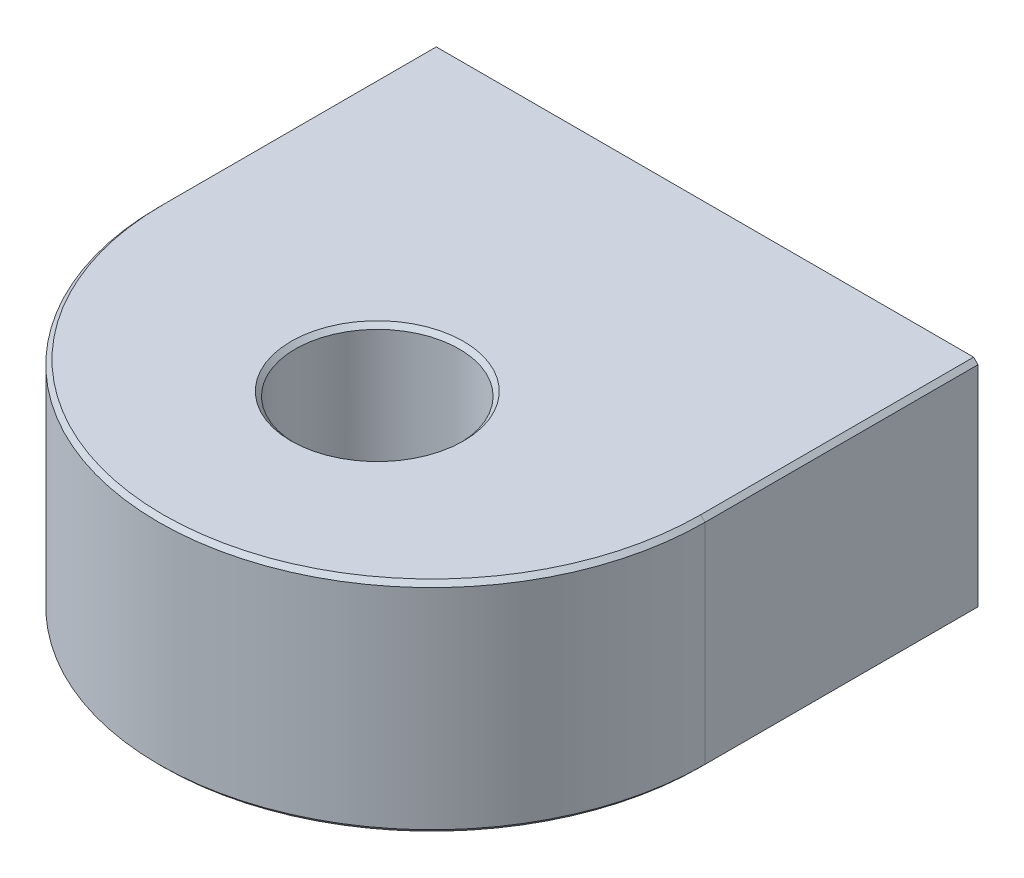
ISO-10303-21;
HEADER;
FILE_DESCRIPTION(('STEP AP214'),'2;1');
FILE_NAME('part.step','',(''),(''),'','','');
FILE_SCHEMA(('AUTOMOTIVE_DESIGN { 1 0 10303 214 1 1 1 1 }'));
ENDSEC;
DATA;
#1=APPLICATION_CONTEXT('core data for automotive mechanical design processes');
#2=APPLICATION_PROTOCOL_DEFINITION('international standard','automotive_design',2000,#1);
#3=PRODUCT_CONTEXT('',#1,'mechanical');
#4=PRODUCT('Part','Part','',(#3));
#5=PRODUCT_RELATED_PRODUCT_CATEGORY('part','',(#4));
#6=PRODUCT_DEFINITION_FORMATION('','',#4);
#7=PRODUCT_DEFINITION_CONTEXT('part definition',#1,'design');
#8=PRODUCT_DEFINITION('design','',#6,#7);
#9=PRODUCT_DEFINITION_SHAPE('','',#8);
#10=(LENGTH_UNIT() NAMED_UNIT(*) SI_UNIT(.MILLI.,.METRE.));
#11=(NAMED_UNIT(*) PLANE_ANGLE_UNIT() SI_UNIT($,.RADIAN.));
#12=(NAMED_UNIT(*) SI_UNIT($,.STERADIAN.) SOLID_ANGLE_UNIT());
#13=UNCERTAINTY_MEASURE_WITH_UNIT(LENGTH_MEASURE(1.E-05),#10,'distance_accuracy_value','');
#14=(GEOMETRIC_REPRESENTATION_CONTEXT(3) GLOBAL_UNCERTAINTY_ASSIGNED_CONTEXT((#13)) GLOBAL_UNIT_ASSIGNED_CONTEXT((#10,
#11,#12)) REPRESENTATION_CONTEXT('',''));
#15=CARTESIAN_POINT('',(0.,0.,0.));
#16=DIRECTION('',(0.,0.,1.));
#17=DIRECTION('',(1.,0.,0.));
#18=AXIS2_PLACEMENT_3D('',#15,#16,#17);
#19=CARTESIAN_POINT('',(15.875,6.35,4.7625));
#20=DIRECTION('',(0.,0.,-1.));
#21=DIRECTION('',(-1.,0.,0.));
#22=AXIS2_PLACEMENT_3D('',#19,#20,#21);
#23=PLANE('',#22);
#24=CARTESIAN_POINT('',(15.875,6.35,4.7625));
#25=DIRECTION('',(0.,0.,-1.));
#26=DIRECTION('',(-1.,0.,0.));
#27=AXIS2_PLACEMENT_3D('',#24,#25,#26);
#28=CIRCLE('',#27,4.7625);
#29=CARTESIAN_POINT('',(11.1125,6.35,4.7625));
#30=VERTEX_POINT('',#29);
#31=EDGE_CURVE('E20',#30,#30,#28,.T.);
#32=ORIENTED_EDGE('',*,*,#31,.T.);
#33=EDGE_LOOP('',(#32));
#34=FACE_BOUND('',#33,.T.);
#35=ADVANCED_FACE('F17',(#34),#23,.T.);
#36=CARTESIAN_POINT('',(5.207,6.35,19.05));
#37=DIRECTION('',(0.,0.,-1.));
#38=DIRECTION('',(-1.,0.,0.));
#39=AXIS2_PLACEMENT_3D('',#36,#37,#38);
#40=PLANE('',#39);
#41=CARTESIAN_POINT('',(5.207,6.35,19.05));
#42=DIRECTION('',(0.,0.,-1.));
#43=DIRECTION('',(-1.,0.,0.));
#44=AXIS2_PLACEMENT_3D('',#41,#42,#43);
#45=CIRCLE('',#44,2.0193);
#46=CARTESIAN_POINT('',(3.18769999999999,6.35,19.05));
#47=VERTEX_POINT('',#46);
#48=EDGE_CURVE('E124',#47,#47,#45,.T.);
#49=ORIENTED_EDGE('',*,*,#48,.T.);
#50=EDGE_LOOP('',(#49));
#51=FACE_BOUND('',#50,.T.);
#52=ADVANCED_FACE('F203',(#51),#40,.T.);
#53=CARTESIAN_POINT('',(26.543,6.35,19.05));
#54=DIRECTION('',(0.,0.,-1.));
#55=DIRECTION('',(-1.,0.,0.));
#56=AXIS2_PLACEMENT_3D('',#53,#54,#55);
#57=PLANE('',#56);
#58=CARTESIAN_POINT('',(26.543,6.35,19.05));
#59=DIRECTION('',(0.,0.,-1.));
#60=DIRECTION('',(-1.,0.,0.));
#61=AXIS2_PLACEMENT_3D('',#58,#59,#60);
#62=CIRCLE('',#61,2.0193);
#63=CARTESIAN_POINT('',(24.5237,6.35,19.05));
#64=VERTEX_POINT('',#63);
#65=EDGE_CURVE('E74',#64,#64,#62,.T.);
#66=ORIENTED_EDGE('',*,*,#65,.T.);
#67=EDGE_LOOP('',(#66));
#68=FACE_BOUND('',#67,.T.);
#69=ADVANCED_FACE('F200',(#68),#57,.T.);
#70=CARTESIAN_POINT('',(15.875,12.6999999999953,19.05));
#71=DIRECTION('',(0.,1.,0.));
#72=DIRECTION('',(0.,0.,1.));
#73=AXIS2_PLACEMENT_3D('',#70,#71,#72);
#74=CONICAL_SURFACE('',#73,5.0164999999467,0.785398163397448);
#75=CARTESIAN_POINT('',(15.875,12.6999999999953,19.05));
#76=DIRECTION('',(0.,1.,0.));
#77=DIRECTION('',(0.,0.,1.));
#78=AXIS2_PLACEMENT_3D('',#75,#76,#77);
#79=CIRCLE('',#78,5.0164999999467);
#80=CARTESIAN_POINT('',(15.875,12.6999999999953,24.0664999999467));
#81=VERTEX_POINT('',#80);
#82=EDGE_CURVE('E119',#81,#81,#79,.T.);
#83=ORIENTED_EDGE('',*,*,#82,.T.);
#84=EDGE_LOOP('',(#83));
#85=FACE_BOUND('',#84,.T.);
#86=CARTESIAN_POINT('',(15.875,12.446,19.05));
#87=DIRECTION('',(0.,1.,0.));
#88=DIRECTION('',(0.,0.,1.));
#89=AXIS2_PLACEMENT_3D('',#86,#87,#88);
#90=CIRCLE('',#89,4.7625);
#91=CARTESIAN_POINT('',(15.875,12.446,23.8125));
#92=VERTEX_POINT('',#91);
#93=EDGE_CURVE('E98',#92,#92,#90,.F.);
#94=ORIENTED_EDGE('',*,*,#93,.T.);
#95=EDGE_LOOP('',(#94));
#96=FACE_BOUND('',#95,.T.);
#97=ADVANCED_FACE('F202',(#85,#96),#74,.F.);
#98=CARTESIAN_POINT('',(31.75,12.446,0.));
#99=DIRECTION('',(0.707106781186557,0.707106781186538,0.));
#100=DIRECTION('',(-0.707106781186538,0.707106781186557,0.));
#101=AXIS2_PLACEMENT_3D('',#98,#99,#100);
#102=PLANE('',#101);
#103=DIRECTION('',(-0.707106781186538,0.707106781186557,0.));
#104=VECTOR('',#103,1.);
#105=CARTESIAN_POINT('',(31.496,12.7,15.875));
#106=LINE('',#105,#104);
#107=CARTESIAN_POINT('',(31.75,12.446,15.875));
#108=VERTEX_POINT('',#107);
#109=CARTESIAN_POINT('',(31.496,12.7,15.875));
#110=VERTEX_POINT('',#109);
#111=EDGE_CURVE('E70',#108,#110,#106,.T.);
#112=ORIENTED_EDGE('',*,*,#111,.F.);
#113=DIRECTION('',(0.,0.,-1.));
#114=VECTOR('',#113,1.);
#115=CARTESIAN_POINT('',(31.75,12.446,0.));
#116=LINE('',#115,#114);
#117=CARTESIAN_POINT('',(31.75,12.446,0.));
#118=VERTEX_POINT('',#117);
#119=EDGE_CURVE('E121',#118,#108,#116,.F.);
#120=ORIENTED_EDGE('',*,*,#119,.F.);
#121=DIRECTION('',(-0.707106781186538,0.707106781186557,0.));
#122=VECTOR('',#121,1.);
#123=CARTESIAN_POINT('',(31.75,12.446,0.));
#124=LINE('',#123,#122);
#125=CARTESIAN_POINT('',(31.496,12.7,0.));
#126=VERTEX_POINT('',#125);
#127=EDGE_CURVE('E73',#118,#126,#124,.T.);
#128=ORIENTED_EDGE('',*,*,#127,.T.);
#129=DIRECTION('',(0.,0.,-1.));
#130=VECTOR('',#129,1.);
#131=CARTESIAN_POINT('',(31.496,12.7,0.));
#132=LINE('',#131,#130);
#133=EDGE_CURVE('E60',#126,#110,#132,.F.);
#134=ORIENTED_EDGE('',*,*,#133,.T.);
#135=EDGE_LOOP('',(#112,#120,#128,#134));
#136=FACE_BOUND('',#135,.T.);
#137=ADVANCED_FACE('F68',(#136),#102,.T.);
#138=CARTESIAN_POINT('',(15.875,12.446,15.875));
#139=DIRECTION('',(0.,-1.,0.));
#140=DIRECTION('',(0.,0.,-1.));
#141=AXIS2_PLACEMENT_3D('',#138,#139,#140);
#142=CONICAL_SURFACE('',#141,15.875,0.785398163397442);
#143=DIRECTION('',(-0.707106781186541,-0.707106781186554,0.));
#144=VECTOR('',#143,1.);
#145=CARTESIAN_POINT('',(0.,12.446,15.875));
#146=LINE('',#145,#144);
#147=CARTESIAN_POINT('',(0.,12.446,15.875));
#148=VERTEX_POINT('',#147);
#149=CARTESIAN_POINT('',(0.253999999999989,12.7,15.875));
#150=VERTEX_POINT('',#149);
#151=EDGE_CURVE('E79',#148,#150,#146,.F.);
#152=ORIENTED_EDGE('',*,*,#151,.F.);
#153=CARTESIAN_POINT('',(15.875,12.446,15.875));
#154=DIRECTION('',(0.,-1.,0.));
#155=DIRECTION('',(0.,0.,-1.));
#156=AXIS2_PLACEMENT_3D('',#153,#154,#155);
#157=CIRCLE('',#156,15.875);
#158=EDGE_CURVE('E78',#108,#148,#157,.T.);
#159=ORIENTED_EDGE('',*,*,#158,.F.);
#160=ORIENTED_EDGE('',*,*,#111,.T.);
#161=CARTESIAN_POINT('',(15.875,12.7,15.875));
#162=DIRECTION('',(0.,-1.,0.));
#163=DIRECTION('',(0.,0.,-1.));
#164=AXIS2_PLACEMENT_3D('',#161,#162,#163);
#165=CIRCLE('',#164,15.621);
#166=EDGE_CURVE('E48',#110,#150,#165,.T.);
#167=ORIENTED_EDGE('',*,*,#166,.T.);
#168=EDGE_LOOP('',(#152,#159,#160,#167));
#169=FACE_BOUND('',#168,.T.);
#170=ADVANCED_FACE('F76',(#169),#142,.T.);
#171=CARTESIAN_POINT('',(0.,12.446,31.75));
#172=DIRECTION('',(-0.707106781186554,0.707106781186541,0.));
#173=DIRECTION('',(-0.707106781186541,-0.707106781186554,0.));
#174=AXIS2_PLACEMENT_3D('',#171,#172,#173);
#175=PLANE('',#174);
#176=DIRECTION('',(-0.707106781186541,-0.707106781186554,0.));
#177=VECTOR('',#176,1.);
#178=CARTESIAN_POINT('',(0.,12.446,0.));
#179=LINE('',#178,#177);
#180=CARTESIAN_POINT('',(0.253999999999991,12.7,0.));
#181=VERTEX_POINT('',#180);
#182=CARTESIAN_POINT('',(0.,12.446,0.));
#183=VERTEX_POINT('',#182);
#184=EDGE_CURVE('E81',#181,#183,#179,.T.);
#185=ORIENTED_EDGE('',*,*,#184,.T.);
#186=DIRECTION('',(0.,0.,1.));
#187=VECTOR('',#186,1.);
#188=CARTESIAN_POINT('',(0.,12.446,31.75));
#189=LINE('',#188,#187);
#190=EDGE_CURVE('E225',#148,#183,#189,.F.);
#191=ORIENTED_EDGE('',*,*,#190,.F.);
#192=ORIENTED_EDGE('',*,*,#151,.T.);
#193=DIRECTION('',(0.,0.,-1.));
#194=VECTOR('',#193,1.);
#195=CARTESIAN_POINT('',(0.253999999999991,12.7,0.));
#196=LINE('',#195,#194);
#197=EDGE_CURVE('E63',#150,#181,#196,.T.);
#198=ORIENTED_EDGE('',*,*,#197,.T.);
#199=EDGE_LOOP('',(#185,#191,#192,#198));
#200=FACE_BOUND('',#199,.T.);
#201=ADVANCED_FACE('F146',(#200),#175,.T.);
#202=CARTESIAN_POINT('',(15.875,0.,19.05));
#203=DIRECTION('',(0.,1.,0.));
#204=DIRECTION('',(0.,0.,1.));
#205=AXIS2_PLACEMENT_3D('',#202,#203,#204);
#206=CYLINDRICAL_SURFACE('',#205,4.7625);
#207=CARTESIAN_POINT('',(15.875,0.253999999983989,19.05));
#208=DIRECTION('',(0.,-1.,0.));
#209=DIRECTION('',(0.,0.,-1.));
#210=AXIS2_PLACEMENT_3D('',#207,#208,#209);
#211=CIRCLE('',#210,4.76250000003374);
#212=CARTESIAN_POINT('',(15.875,0.253999999983989,14.2874999999663));
#213=VERTEX_POINT('',#212);
#214=EDGE_CURVE('E118',#213,#213,#211,.T.);
#215=ORIENTED_EDGE('',*,*,#214,.T.);
#216=EDGE_LOOP('',(#215));
#217=FACE_BOUND('',#216,.T.);
#218=ORIENTED_EDGE('',*,*,#93,.F.);
#219=EDGE_LOOP('',(#218));
#220=FACE_BOUND('',#219,.T.);
#221=ADVANCED_FACE('F135',(#217,#220),#206,.F.);
#222=CARTESIAN_POINT('',(15.875,6.35,4.7625));
#223=DIRECTION('',(0.,0.,-1.));
#224=DIRECTION('',(-1.,0.,0.));
#225=AXIS2_PLACEMENT_3D('',#222,#223,#224);
#226=CYLINDRICAL_SURFACE('',#225,4.7625);
#227=CARTESIAN_POINT('',(15.875,6.35,0.));
#228=DIRECTION('',(0.,0.,-1.));
#229=DIRECTION('',(-1.,0.,0.));
#230=AXIS2_PLACEMENT_3D('',#227,#228,#229);
#231=CIRCLE('',#230,4.7625);
#232=CARTESIAN_POINT('',(11.1125,6.35,0.));
#233=VERTEX_POINT('',#232);
#234=EDGE_CURVE('E115',#233,#233,#231,.F.);
#235=ORIENTED_EDGE('',*,*,#234,.F.);
#236=EDGE_LOOP('',(#235));
#237=FACE_BOUND('',#236,.T.);
#238=ORIENTED_EDGE('',*,*,#31,.F.);
#239=EDGE_LOOP('',(#238));
#240=FACE_BOUND('',#239,.T.);
#241=ADVANCED_FACE('F132',(#237,#240),#226,.F.);
#242=CARTESIAN_POINT('',(5.207,6.35,19.05));
#243=DIRECTION('',(0.,0.,-1.));
#244=DIRECTION('',(-1.,0.,0.));
#245=AXIS2_PLACEMENT_3D('',#242,#243,#244);
#246=CYLINDRICAL_SURFACE('',#245,2.0193);
#247=CARTESIAN_POINT('',(5.207,6.35,0.));
#248=DIRECTION('',(0.,0.,-1.));
#249=DIRECTION('',(-1.,0.,0.));
#250=AXIS2_PLACEMENT_3D('',#247,#248,#249);
#251=CIRCLE('',#250,2.0193);
#252=CARTESIAN_POINT('',(3.18769999999999,6.35,0.));
#253=VERTEX_POINT('',#252);
#254=EDGE_CURVE('E112',#253,#253,#251,.F.);
#255=ORIENTED_EDGE('',*,*,#254,.F.);
#256=EDGE_LOOP('',(#255));
#257=FACE_BOUND('',#256,.T.);
#258=ORIENTED_EDGE('',*,*,#48,.F.);
#259=EDGE_LOOP('',(#258));
#260=FACE_BOUND('',#259,.T.);
#261=ADVANCED_FACE('F134',(#257,#260),#246,.F.);
#262=CARTESIAN_POINT('',(26.543,6.35,19.05));
#263=DIRECTION('',(0.,0.,-1.));
#264=DIRECTION('',(-1.,0.,0.));
#265=AXIS2_PLACEMENT_3D('',#262,#263,#264);
#266=CYLINDRICAL_SURFACE('',#265,2.0193);
#267=CARTESIAN_POINT('',(26.543,6.35,0.));
#268=DIRECTION('',(0.,0.,-1.));
#269=DIRECTION('',(-1.,0.,0.));
#270=AXIS2_PLACEMENT_3D('',#267,#268,#269);
#271=CIRCLE('',#270,2.0193);
#272=CARTESIAN_POINT('',(24.5237,6.35,0.));
#273=VERTEX_POINT('',#272);
#274=EDGE_CURVE('E108',#273,#273,#271,.F.);
#275=ORIENTED_EDGE('',*,*,#274,.F.);
#276=EDGE_LOOP('',(#275));
#277=FACE_BOUND('',#276,.T.);
#278=ORIENTED_EDGE('',*,*,#65,.F.);
#279=EDGE_LOOP('',(#278));
#280=FACE_BOUND('',#279,.T.);
#281=ADVANCED_FACE('F143',(#277,#280),#266,.F.);
#282=CARTESIAN_POINT('',(0.,12.7,0.));
#283=DIRECTION('',(0.,-1.,0.));
#284=DIRECTION('',(0.,0.,-1.));
#285=AXIS2_PLACEMENT_3D('',#282,#283,#284);
#286=PLANE('',#285);
#287=ORIENTED_EDGE('',*,*,#82,.F.);
#288=EDGE_LOOP('',(#287));
#289=FACE_BOUND('',#288,.T.);
#290=ORIENTED_EDGE('',*,*,#197,.F.);
#291=ORIENTED_EDGE('',*,*,#166,.F.);
#292=ORIENTED_EDGE('',*,*,#133,.F.);
#293=DIRECTION('',(-1.,0.,0.));
#294=VECTOR('',#293,1.);
#295=CARTESIAN_POINT('',(0.,12.7,0.));
#296=LINE('',#295,#294);
#297=EDGE_CURVE('E92',#181,#126,#296,.F.);
#298=ORIENTED_EDGE('',*,*,#297,.F.);
#299=EDGE_LOOP('',(#290,#291,#292,#298));
#300=FACE_BOUND('',#299,.T.);
#301=ADVANCED_FACE('F57',(#289,#300),#286,.F.);
#302=CARTESIAN_POINT('',(31.75,12.7,0.));
#303=DIRECTION('',(1.,0.,0.));
#304=DIRECTION('',(0.,0.,-1.));
#305=AXIS2_PLACEMENT_3D('',#302,#303,#304);
#306=PLANE('',#305);
#307=DIRECTION('',(0.,1.,0.));
#308=VECTOR('',#307,1.);
#309=CARTESIAN_POINT('',(31.75,12.7,0.));
#310=LINE('',#309,#308);
#311=CARTESIAN_POINT('',(31.75,0.254000000000004,0.));
#312=VERTEX_POINT('',#311);
#313=EDGE_CURVE('E111',#118,#312,#310,.F.);
#314=ORIENTED_EDGE('',*,*,#313,.F.);
#315=ORIENTED_EDGE('',*,*,#119,.T.);
#316=DIRECTION('',(0.,-1.,0.));
#317=VECTOR('',#316,1.);
#318=CARTESIAN_POINT('',(31.75,12.7,15.875));
#319=LINE('',#318,#317);
#320=CARTESIAN_POINT('',(31.75,0.254000000000004,15.875));
#321=VERTEX_POINT('',#320);
#322=EDGE_CURVE('E265',#321,#108,#319,.F.);
#323=ORIENTED_EDGE('',*,*,#322,.F.);
#324=DIRECTION('',(0.,0.,1.));
#325=VECTOR('',#324,1.);
#326=CARTESIAN_POINT('',(31.75,0.254000000000004,0.));
#327=LINE('',#326,#325);
#328=EDGE_CURVE('E94',#321,#312,#327,.F.);
#329=ORIENTED_EDGE('',*,*,#328,.T.);
#330=EDGE_LOOP('',(#314,#315,#323,#329));
#331=FACE_BOUND('',#330,.T.);
#332=ADVANCED_FACE('F184',(#331),#306,.T.);
#333=CARTESIAN_POINT('',(15.875,12.7,15.875));
#334=DIRECTION('',(0.,-1.,0.));
#335=DIRECTION('',(0.,0.,-1.));
#336=AXIS2_PLACEMENT_3D('',#333,#334,#335);
#337=CYLINDRICAL_SURFACE('',#336,15.875);
#338=CARTESIAN_POINT('',(15.875,0.254000000000003,15.875));
#339=DIRECTION('',(0.,1.,0.));
#340=DIRECTION('',(0.,0.,1.));
#341=AXIS2_PLACEMENT_3D('',#338,#339,#340);
#342=CIRCLE('',#341,15.875);
#343=CARTESIAN_POINT('',(0.,0.254000000000003,15.875));
#344=VERTEX_POINT('',#343);
#345=EDGE_CURVE('E254',#321,#344,#342,.F.);
#346=ORIENTED_EDGE('',*,*,#345,.F.);
#347=ORIENTED_EDGE('',*,*,#322,.T.);
#348=ORIENTED_EDGE('',*,*,#158,.T.);
#349=DIRECTION('',(0.,1.,0.));
#350=VECTOR('',#349,1.);
#351=CARTESIAN_POINT('',(0.,12.7,15.875));
#352=LINE('',#351,#350);
#353=EDGE_CURVE('E236',#344,#148,#352,.T.);
#354=ORIENTED_EDGE('',*,*,#353,.F.);
#355=EDGE_LOOP('',(#346,#347,#348,#354));
#356=FACE_BOUND('',#355,.T.);
#357=ADVANCED_FACE('F180',(#356),#337,.T.);
#358=CARTESIAN_POINT('',(0.,12.7,31.75));
#359=DIRECTION('',(-1.,0.,0.));
#360=DIRECTION('',(0.,0.,1.));
#361=AXIS2_PLACEMENT_3D('',#358,#359,#360);
#362=PLANE('',#361);
#363=ORIENTED_EDGE('',*,*,#353,.T.);
#364=ORIENTED_EDGE('',*,*,#190,.T.);
#365=DIRECTION('',(0.,1.,0.));
#366=VECTOR('',#365,1.);
#367=CARTESIAN_POINT('',(0.,12.7,0.));
#368=LINE('',#367,#366);
#369=CARTESIAN_POINT('',(0.,0.254000000000004,0.));
#370=VERTEX_POINT('',#369);
#371=EDGE_CURVE('E95',#370,#183,#368,.T.);
#372=ORIENTED_EDGE('',*,*,#371,.F.);
#373=DIRECTION('',(0.,0.,1.));
#374=VECTOR('',#373,1.);
#375=CARTESIAN_POINT('',(0.,0.254000000000004,0.));
#376=LINE('',#375,#374);
#377=EDGE_CURVE('E251',#370,#344,#376,.T.);
#378=ORIENTED_EDGE('',*,*,#377,.T.);
#379=EDGE_LOOP('',(#363,#364,#372,#378));
#380=FACE_BOUND('',#379,.T.);
#381=ADVANCED_FACE('F176',(#380),#362,.T.);
#382=CARTESIAN_POINT('',(15.875,1.13686837721616E-10,19.05));
#383=DIRECTION('',(0.,-1.,0.));
#384=DIRECTION('',(0.,0.,-1.));
#385=AXIS2_PLACEMENT_3D('',#382,#383,#384);
#386=CONICAL_SURFACE('',#385,5.01649999996089,0.785398163509345);
#387=ORIENTED_EDGE('',*,*,#214,.F.);
#388=EDGE_LOOP('',(#387));
#389=FACE_BOUND('',#388,.T.);
#390=CARTESIAN_POINT('',(15.875,6.39384378886865E-11,19.05));
#391=DIRECTION('',(0.,-1.,0.));
#392=DIRECTION('',(0.,0.,-1.));
#393=AXIS2_PLACEMENT_3D('',#390,#391,#392);
#394=CIRCLE('',#393,5.01650000001064);
#395=CARTESIAN_POINT('',(15.875,6.39384378886865E-11,14.0334999999894));
#396=VERTEX_POINT('',#395);
#397=EDGE_CURVE('E103',#396,#396,#394,.F.);
#398=ORIENTED_EDGE('',*,*,#397,.F.);
#399=EDGE_LOOP('',(#398));
#400=FACE_BOUND('',#399,.T.);
#401=ADVANCED_FACE('F172',(#389,#400),#386,.F.);
#402=CARTESIAN_POINT('',(0.,12.7,0.));
#403=DIRECTION('',(0.,0.,-1.));
#404=DIRECTION('',(-1.,0.,0.));
#405=AXIS2_PLACEMENT_3D('',#402,#403,#404);
#406=PLANE('',#405);
#407=ORIENTED_EDGE('',*,*,#297,.T.);
#408=ORIENTED_EDGE('',*,*,#127,.F.);
#409=ORIENTED_EDGE('',*,*,#313,.T.);
#410=DIRECTION('',(-0.707106781186548,-0.707106781186548,0.));
#411=VECTOR('',#410,1.);
#412=CARTESIAN_POINT('',(31.496,0.,0.));
#413=LINE('',#412,#411);
#414=CARTESIAN_POINT('',(31.496,0.,0.));
#415=VERTEX_POINT('',#414);
#416=EDGE_CURVE('E272',#312,#415,#413,.T.);
#417=ORIENTED_EDGE('',*,*,#416,.T.);
#418=DIRECTION('',(1.,0.,0.));
#419=VECTOR('',#418,1.);
#420=CARTESIAN_POINT('',(0.,0.,0.));
#421=LINE('',#420,#419);
#422=CARTESIAN_POINT('',(0.253999999999998,0.,0.));
#423=VERTEX_POINT('',#422);
#424=EDGE_CURVE('E106',#423,#415,#421,.T.);
#425=ORIENTED_EDGE('',*,*,#424,.F.);
#426=DIRECTION('',(-0.707106781186544,0.707106781186552,0.));
#427=VECTOR('',#426,1.);
#428=CARTESIAN_POINT('',(0.253999999999998,0.,0.));
#429=LINE('',#428,#427);
#430=EDGE_CURVE('E107',#423,#370,#429,.T.);
#431=ORIENTED_EDGE('',*,*,#430,.T.);
#432=ORIENTED_EDGE('',*,*,#371,.T.);
#433=ORIENTED_EDGE('',*,*,#184,.F.);
#434=EDGE_LOOP('',(#407,#408,#409,#417,#425,#431,#432,#433));
#435=FACE_BOUND('',#434,.T.);
#436=ORIENTED_EDGE('',*,*,#274,.T.);
#437=EDGE_LOOP('',(#436));
#438=FACE_BOUND('',#437,.T.);
#439=ORIENTED_EDGE('',*,*,#254,.T.);
#440=EDGE_LOOP('',(#439));
#441=FACE_BOUND('',#440,.T.);
#442=ORIENTED_EDGE('',*,*,#234,.T.);
#443=EDGE_LOOP('',(#442));
#444=FACE_BOUND('',#443,.T.);
#445=ADVANCED_FACE('F168',(#435,#438,#441,#444),#406,.T.);
#446=CARTESIAN_POINT('',(31.496,0.,0.));
#447=DIRECTION('',(-0.707106781186548,0.707106781186548,0.));
#448=DIRECTION('',(-0.707106781186548,-0.707106781186548,0.));
#449=AXIS2_PLACEMENT_3D('',#446,#447,#448);
#450=PLANE('',#449);
#451=ORIENTED_EDGE('',*,*,#328,.F.);
#452=DIRECTION('',(-0.707106781186547,-0.707106781186548,0.));
#453=VECTOR('',#452,1.);
#454=CARTESIAN_POINT('',(31.496,0.,15.875));
#455=LINE('',#454,#453);
#456=CARTESIAN_POINT('',(31.496,0.,15.875));
#457=VERTEX_POINT('',#456);
#458=EDGE_CURVE('E259',#457,#321,#455,.F.);
#459=ORIENTED_EDGE('',*,*,#458,.F.);
#460=DIRECTION('',(0.,0.,-1.));
#461=VECTOR('',#460,1.);
#462=CARTESIAN_POINT('',(31.496,0.,0.));
#463=LINE('',#462,#461);
#464=EDGE_CURVE('E102',#415,#457,#463,.F.);
#465=ORIENTED_EDGE('',*,*,#464,.F.);
#466=ORIENTED_EDGE('',*,*,#416,.F.);
#467=EDGE_LOOP('',(#451,#459,#465,#466));
#468=FACE_BOUND('',#467,.T.);
#469=ADVANCED_FACE('F164',(#468),#450,.F.);
#470=CARTESIAN_POINT('',(15.875,0.254000000000002,15.875));
#471=DIRECTION('',(0.,1.,0.));
#472=DIRECTION('',(0.,0.,1.));
#473=AXIS2_PLACEMENT_3D('',#470,#471,#472);
#474=CONICAL_SURFACE('',#473,15.875,0.785398163397439);
#475=DIRECTION('',(-0.707106781186544,0.707106781186552,0.));
#476=VECTOR('',#475,1.);
#477=CARTESIAN_POINT('',(0.253999999999997,0.,15.875));
#478=LINE('',#477,#476);
#479=CARTESIAN_POINT('',(0.253999999999996,0.,15.875));
#480=VERTEX_POINT('',#479);
#481=EDGE_CURVE('E253',#344,#480,#478,.F.);
#482=ORIENTED_EDGE('',*,*,#481,.T.);
#483=CARTESIAN_POINT('',(15.875,0.,15.875));
#484=DIRECTION('',(0.,1.,0.));
#485=DIRECTION('',(0.,0.,1.));
#486=AXIS2_PLACEMENT_3D('',#483,#484,#485);
#487=CIRCLE('',#486,15.621);
#488=EDGE_CURVE('E26',#457,#480,#487,.F.);
#489=ORIENTED_EDGE('',*,*,#488,.F.);
#490=ORIENTED_EDGE('',*,*,#458,.T.);
#491=ORIENTED_EDGE('',*,*,#345,.T.);
#492=EDGE_LOOP('',(#482,#489,#490,#491));
#493=FACE_BOUND('',#492,.T.);
#494=ADVANCED_FACE('F157',(#493),#474,.T.);
#495=CARTESIAN_POINT('',(0.253999999999998,0.,0.));
#496=DIRECTION('',(0.707106781186552,0.707106781186544,0.));
#497=DIRECTION('',(-0.707106781186544,0.707106781186552,0.));
#498=AXIS2_PLACEMENT_3D('',#495,#496,#497);
#499=PLANE('',#498);
#500=DIRECTION('',(0.,0.,-1.));
#501=VECTOR('',#500,1.);
#502=CARTESIAN_POINT('',(0.253999999999998,0.,0.));
#503=LINE('',#502,#501);
#504=EDGE_CURVE('E11',#480,#423,#503,.T.);
#505=ORIENTED_EDGE('',*,*,#504,.F.);
#506=ORIENTED_EDGE('',*,*,#481,.F.);
#507=ORIENTED_EDGE('',*,*,#377,.F.);
#508=ORIENTED_EDGE('',*,*,#430,.F.);
#509=EDGE_LOOP('',(#505,#506,#507,#508));
#510=FACE_BOUND('',#509,.T.);
#511=ADVANCED_FACE('F152',(#510),#499,.F.);
#512=CARTESIAN_POINT('',(0.,0.,0.));
#513=DIRECTION('',(0.,-1.,0.));
#514=DIRECTION('',(0.,0.,-1.));
#515=AXIS2_PLACEMENT_3D('',#512,#513,#514);
#516=PLANE('',#515);
#517=ORIENTED_EDGE('',*,*,#488,.T.);
#518=ORIENTED_EDGE('',*,*,#504,.T.);
#519=ORIENTED_EDGE('',*,*,#424,.T.);
#520=ORIENTED_EDGE('',*,*,#464,.T.);
#521=EDGE_LOOP('',(#517,#518,#519,#520));
#522=FACE_BOUND('',#521,.T.);
#523=ORIENTED_EDGE('',*,*,#397,.T.);
#524=EDGE_LOOP('',(#523));
#525=FACE_BOUND('',#524,.T.);
#526=ADVANCED_FACE('F150',(#522,#525),#516,.T.);
#527=CLOSED_SHELL('',(#35,#52,#69,#97,#137,#170,#201,#221,#241,#261,#281,#301,#332,#357,#381,
#401,#445,#469,#494,#511,#526));
#528=MANIFOLD_SOLID_BREP('B1',#527);
#529=ADVANCED_BREP_SHAPE_REPRESENTATION('',(#18,#528),#14);
#530=SHAPE_DEFINITION_REPRESENTATION(#9,#529);
ENDSEC;
END-ISO-10303-21;
